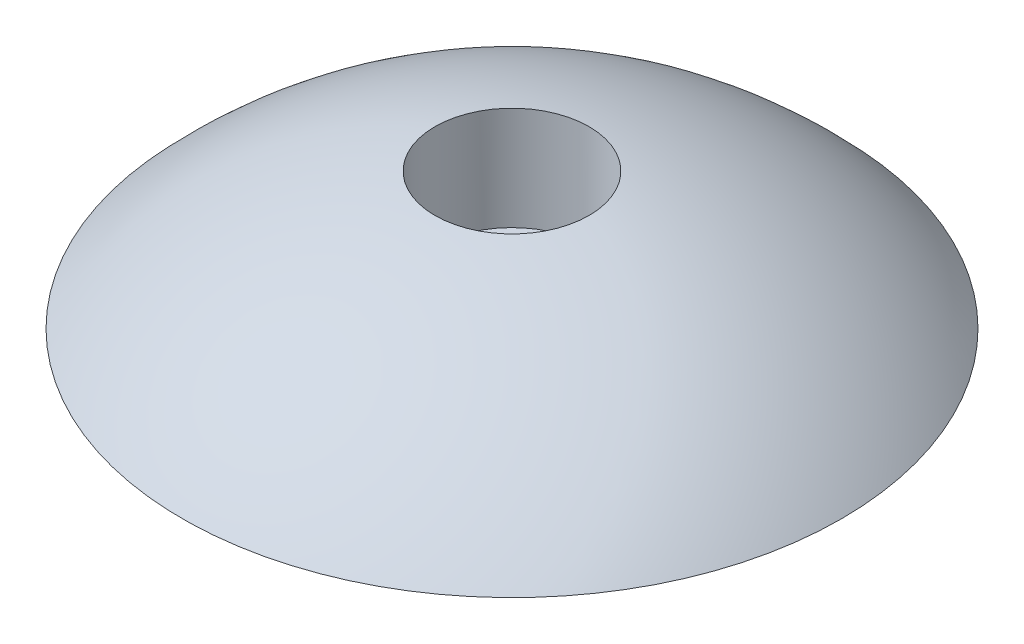
ISO-10303-21;
HEADER;
FILE_DESCRIPTION(('STEP AP214'),'2;1');
FILE_NAME('part.step','',(''),(''),'','','');
FILE_SCHEMA(('AUTOMOTIVE_DESIGN { 1 0 10303 214 1 1 1 1 }'));
ENDSEC;
DATA;
#1=APPLICATION_CONTEXT('core data for automotive mechanical design processes');
#2=APPLICATION_PROTOCOL_DEFINITION('international standard','automotive_design',2000,#1);
#3=PRODUCT_CONTEXT('',#1,'mechanical');
#4=PRODUCT('Part','Part','',(#3));
#5=PRODUCT_RELATED_PRODUCT_CATEGORY('part','',(#4));
#6=PRODUCT_DEFINITION_FORMATION('','',#4);
#7=PRODUCT_DEFINITION_CONTEXT('part definition',#1,'design');
#8=PRODUCT_DEFINITION('design','',#6,#7);
#9=PRODUCT_DEFINITION_SHAPE('','',#8);
#10=(LENGTH_UNIT() NAMED_UNIT(*) SI_UNIT(.MILLI.,.METRE.));
#11=(NAMED_UNIT(*) PLANE_ANGLE_UNIT() SI_UNIT($,.RADIAN.));
#12=(NAMED_UNIT(*) SI_UNIT($,.STERADIAN.) SOLID_ANGLE_UNIT());
#13=UNCERTAINTY_MEASURE_WITH_UNIT(LENGTH_MEASURE(1.E-05),#10,'distance_accuracy_value','');
#14=(GEOMETRIC_REPRESENTATION_CONTEXT(3) GLOBAL_UNCERTAINTY_ASSIGNED_CONTEXT((#13)) GLOBAL_UNIT_ASSIGNED_CONTEXT((#10,
#11,#12)) REPRESENTATION_CONTEXT('',''));
#15=CARTESIAN_POINT('',(0.,0.,0.));
#16=DIRECTION('',(0.,0.,1.));
#17=DIRECTION('',(1.,0.,0.));
#18=AXIS2_PLACEMENT_3D('',#15,#16,#17);
#19=CARTESIAN_POINT('',(0.,0.,0.));
#20=DIRECTION('',(0.,0.,1.));
#21=DIRECTION('',(1.,0.,0.));
#22=AXIS2_PLACEMENT_3D('',#19,#20,#21);
#23=SPHERICAL_SURFACE('',#22,20.5);
#24=CARTESIAN_POINT('',(0.,0.,0.));
#25=DIRECTION('',(0.,-1.,0.));
#26=DIRECTION('',(0.,0.,-1.));
#27=AXIS2_PLACEMENT_3D('',#24,#25,#26);
#28=SPHERICAL_SURFACE('',#27,20.5);
#29=CARTESIAN_POINT('',(0.,20.1990098767242,0.));
#30=DIRECTION('',(0.,-1.,0.));
#31=DIRECTION('',(0.,0.,-1.));
#32=AXIS2_PLACEMENT_3D('',#29,#30,#31);
#33=CIRCLE('',#32,3.5);
#34=CARTESIAN_POINT('',(0.,20.1990098767242,-3.5));
#35=VERTEX_POINT('',#34);
#36=EDGE_CURVE('E40',#35,#35,#33,.T.);
#37=ORIENTED_EDGE('',*,*,#36,.T.);
#38=EDGE_LOOP('',(#37));
#39=FACE_BOUND('',#38,.T.);
#40=CARTESIAN_POINT('',(0.,14.,0.));
#41=DIRECTION('',(0.,-1.,0.));
#42=DIRECTION('',(1.,0.,0.));
#43=AXIS2_PLACEMENT_3D('',#40,#41,#42);
#44=CIRCLE('',#43,14.9749791318719);
#45=CARTESIAN_POINT('',(14.974979131872,13.9999999999999,0.));
#46=VERTEX_POINT('',#45);
#47=EDGE_CURVE('E10',#46,#46,#44,.T.);
#48=ORIENTED_EDGE('',*,*,#47,.F.);
#49=EDGE_LOOP('',(#48));
#50=FACE_BOUND('',#49,.T.);
#51=ADVANCED_FACE('F37',(#39,#50),#28,.T.);
#52=CARTESIAN_POINT('',(0.,14.,0.));
#53=DIRECTION('',(0.,-1.,0.));
#54=DIRECTION('',(1.,0.,0.));
#55=AXIS2_PLACEMENT_3D('',#52,#53,#54);
#56=PLANE('',#55);
#57=CARTESIAN_POINT('',(0.,13.9999999999999,0.));
#58=DIRECTION('',(0.,1.,0.));
#59=DIRECTION('',(0.,0.,1.));
#60=AXIS2_PLACEMENT_3D('',#57,#58,#59);
#61=CIRCLE('',#60,1.125);
#62=CARTESIAN_POINT('',(0.,13.9999999999999,1.125));
#63=VERTEX_POINT('',#62);
#64=EDGE_CURVE('E51',#63,#63,#61,.T.);
#65=ORIENTED_EDGE('',*,*,#64,.T.);
#66=EDGE_LOOP('',(#65));
#67=FACE_BOUND('',#66,.T.);
#68=ORIENTED_EDGE('',*,*,#47,.T.);
#69=EDGE_LOOP('',(#68));
#70=FACE_BOUND('',#69,.T.);
#71=ADVANCED_FACE('F58',(#67,#70),#56,.T.);
#72=CARTESIAN_POINT('',(0.,15.5,0.));
#73=DIRECTION('',(0.,1.,0.));
#74=DIRECTION('',(0.,0.,1.));
#75=AXIS2_PLACEMENT_3D('',#72,#73,#74);
#76=CYLINDRICAL_SURFACE('',#75,3.5);
#77=CARTESIAN_POINT('',(0.,15.5,0.));
#78=DIRECTION('',(0.,1.,0.));
#79=DIRECTION('',(0.,0.,1.));
#80=AXIS2_PLACEMENT_3D('',#77,#78,#79);
#81=CIRCLE('',#80,3.5);
#82=CARTESIAN_POINT('',(0.,15.5,3.5));
#83=VERTEX_POINT('',#82);
#84=EDGE_CURVE('E47',#83,#83,#81,.T.);
#85=ORIENTED_EDGE('',*,*,#84,.F.);
#86=EDGE_LOOP('',(#85));
#87=FACE_BOUND('',#86,.T.);
#88=ORIENTED_EDGE('',*,*,#36,.F.);
#89=EDGE_LOOP('',(#88));
#90=FACE_BOUND('',#89,.T.);
#91=ADVANCED_FACE('F69',(#87,#90),#76,.F.);
#92=CARTESIAN_POINT('',(0.,15.5,0.));
#93=DIRECTION('',(0.,1.,0.));
#94=DIRECTION('',(0.,0.,1.));
#95=AXIS2_PLACEMENT_3D('',#92,#93,#94);
#96=PLANE('',#95);
#97=CARTESIAN_POINT('',(0.,15.5,0.));
#98=DIRECTION('',(0.,1.,0.));
#99=DIRECTION('',(0.,0.,1.));
#100=AXIS2_PLACEMENT_3D('',#97,#98,#99);
#101=CIRCLE('',#100,1.125);
#102=CARTESIAN_POINT('',(0.,15.5,1.125));
#103=VERTEX_POINT('',#102);
#104=EDGE_CURVE('E52',#103,#103,#101,.T.);
#105=ORIENTED_EDGE('',*,*,#104,.F.);
#106=EDGE_LOOP('',(#105));
#107=FACE_BOUND('',#106,.T.);
#108=ORIENTED_EDGE('',*,*,#84,.T.);
#109=EDGE_LOOP('',(#108));
#110=FACE_BOUND('',#109,.T.);
#111=ADVANCED_FACE('F63',(#107,#110),#96,.T.);
#112=CARTESIAN_POINT('',(0.,13.9999999999999,0.));
#113=DIRECTION('',(0.,1.,0.));
#114=DIRECTION('',(0.,0.,1.));
#115=AXIS2_PLACEMENT_3D('',#112,#113,#114);
#116=CYLINDRICAL_SURFACE('',#115,1.125);
#117=ORIENTED_EDGE('',*,*,#64,.F.);
#118=EDGE_LOOP('',(#117));
#119=FACE_BOUND('',#118,.T.);
#120=ORIENTED_EDGE('',*,*,#104,.T.);
#121=EDGE_LOOP('',(#120));
#122=FACE_BOUND('',#121,.T.);
#123=ADVANCED_FACE('F60',(#119,#122),#116,.F.);
#124=CLOSED_SHELL('',(#51,#71,#91,#111,#123));
#125=MANIFOLD_SOLID_BREP('B2',#124);
#126=ADVANCED_BREP_SHAPE_REPRESENTATION('',(#18,#125),#14);
#127=SHAPE_DEFINITION_REPRESENTATION(#9,#126);
ENDSEC;
END-ISO-10303-21;
